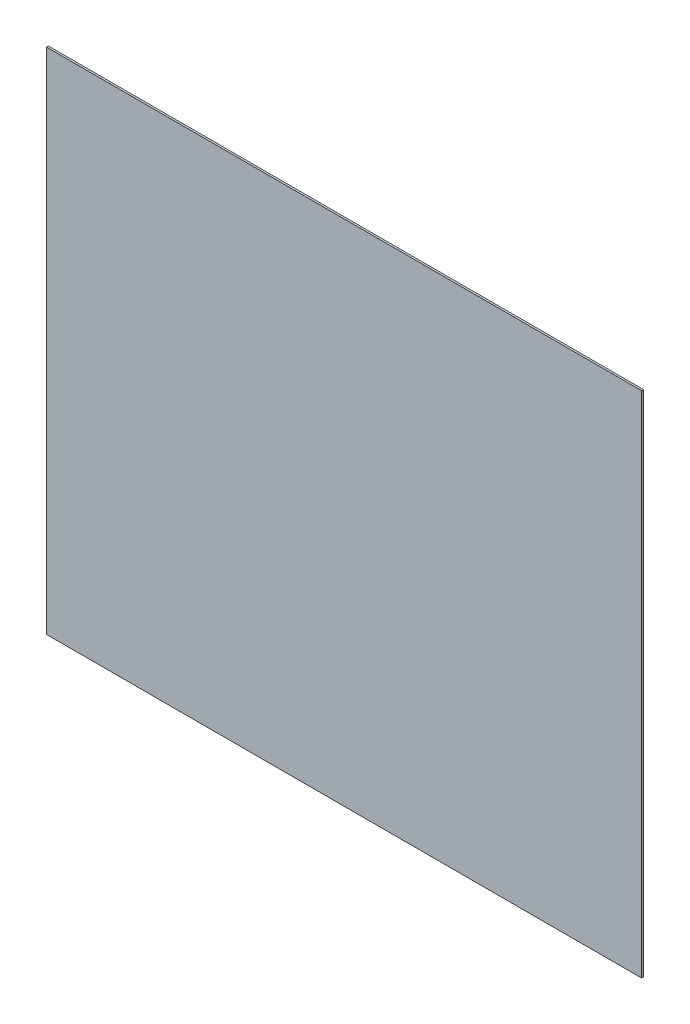
ISO-10303-21;
HEADER;
FILE_DESCRIPTION(('STEP AP214'),'2;1');
FILE_NAME('part.step','',(''),(''),'','','');
FILE_SCHEMA(('AUTOMOTIVE_DESIGN { 1 0 10303 214 1 1 1 1 }'));
ENDSEC;
DATA;
#1=APPLICATION_CONTEXT('core data for automotive mechanical design processes');
#2=APPLICATION_PROTOCOL_DEFINITION('international standard','automotive_design',2000,#1);
#3=PRODUCT_CONTEXT('',#1,'mechanical');
#4=PRODUCT('Part','Part','',(#3));
#5=PRODUCT_RELATED_PRODUCT_CATEGORY('part','',(#4));
#6=PRODUCT_DEFINITION_FORMATION('','',#4);
#7=PRODUCT_DEFINITION_CONTEXT('part definition',#1,'design');
#8=PRODUCT_DEFINITION('design','',#6,#7);
#9=PRODUCT_DEFINITION_SHAPE('','',#8);
#10=(LENGTH_UNIT() NAMED_UNIT(*) SI_UNIT(.MILLI.,.METRE.));
#11=(NAMED_UNIT(*) PLANE_ANGLE_UNIT() SI_UNIT($,.RADIAN.));
#12=(NAMED_UNIT(*) SI_UNIT($,.STERADIAN.) SOLID_ANGLE_UNIT());
#13=UNCERTAINTY_MEASURE_WITH_UNIT(LENGTH_MEASURE(1.E-05),#10,'distance_accuracy_value','');
#14=(GEOMETRIC_REPRESENTATION_CONTEXT(3) GLOBAL_UNCERTAINTY_ASSIGNED_CONTEXT((#13)) GLOBAL_UNIT_ASSIGNED_CONTEXT((#10,
#11,#12)) REPRESENTATION_CONTEXT('',''));
#15=CARTESIAN_POINT('',(0.,0.,0.));
#16=DIRECTION('',(0.,0.,1.));
#17=DIRECTION('',(1.,0.,0.));
#18=AXIS2_PLACEMENT_3D('',#15,#16,#17);
#19=CARTESIAN_POINT('',(0.,530.,2.));
#20=DIRECTION('',(1.,0.,0.));
#21=DIRECTION('',(0.,1.,0.));
#22=AXIS2_PLACEMENT_3D('',#19,#20,#21);
#23=PLANE('',#22);
#24=DIRECTION('',(0.,-1.,0.));
#25=VECTOR('',#24,1.);
#26=CARTESIAN_POINT('',(0.,530.,0.));
#27=LINE('',#26,#25);
#28=CARTESIAN_POINT('',(0.,530.,0.));
#29=VERTEX_POINT('',#28);
#30=CARTESIAN_POINT('',(0.,0.,0.));
#31=VERTEX_POINT('',#30);
#32=EDGE_CURVE('E95',#29,#31,#27,.T.);
#33=ORIENTED_EDGE('',*,*,#32,.T.);
#34=DIRECTION('',(0.,0.,-1.));
#35=VECTOR('',#34,1.);
#36=CARTESIAN_POINT('',(0.,0.,2.));
#37=LINE('',#36,#35);
#38=CARTESIAN_POINT('',(0.,0.,2.));
#39=VERTEX_POINT('',#38);
#40=EDGE_CURVE('E11',#39,#31,#37,.T.);
#41=ORIENTED_EDGE('',*,*,#40,.F.);
#42=DIRECTION('',(0.,-1.,0.));
#43=VECTOR('',#42,1.);
#44=CARTESIAN_POINT('',(0.,530.,2.));
#45=LINE('',#44,#43);
#46=CARTESIAN_POINT('',(0.,530.,2.));
#47=VERTEX_POINT('',#46);
#48=EDGE_CURVE('E83',#47,#39,#45,.T.);
#49=ORIENTED_EDGE('',*,*,#48,.F.);
#50=DIRECTION('',(0.,0.,-1.));
#51=VECTOR('',#50,1.);
#52=CARTESIAN_POINT('',(0.,530.,2.));
#53=LINE('',#52,#51);
#54=EDGE_CURVE('E91',#47,#29,#53,.T.);
#55=ORIENTED_EDGE('',*,*,#54,.T.);
#56=EDGE_LOOP('',(#33,#41,#49,#55));
#57=FACE_BOUND('',#56,.T.);
#58=ADVANCED_FACE('F32',(#57),#23,.F.);
#59=CARTESIAN_POINT('',(0.,0.,2.));
#60=DIRECTION('',(0.,1.,0.));
#61=DIRECTION('',(0.,0.,1.));
#62=AXIS2_PLACEMENT_3D('',#59,#60,#61);
#63=PLANE('',#62);
#64=DIRECTION('',(1.,0.,0.));
#65=VECTOR('',#64,1.);
#66=CARTESIAN_POINT('',(0.,0.,0.));
#67=LINE('',#66,#65);
#68=CARTESIAN_POINT('',(620.,0.,0.));
#69=VERTEX_POINT('',#68);
#70=EDGE_CURVE('E87',#31,#69,#67,.T.);
#71=ORIENTED_EDGE('',*,*,#70,.T.);
#72=DIRECTION('',(0.,0.,-1.));
#73=VECTOR('',#72,1.);
#74=CARTESIAN_POINT('',(620.,0.,2.));
#75=LINE('',#74,#73);
#76=CARTESIAN_POINT('',(620.,0.,2.));
#77=VERTEX_POINT('',#76);
#78=EDGE_CURVE('E40',#77,#69,#75,.T.);
#79=ORIENTED_EDGE('',*,*,#78,.F.);
#80=DIRECTION('',(1.,0.,0.));
#81=VECTOR('',#80,1.);
#82=CARTESIAN_POINT('',(0.,0.,2.));
#83=LINE('',#82,#81);
#84=EDGE_CURVE('E78',#39,#77,#83,.T.);
#85=ORIENTED_EDGE('',*,*,#84,.F.);
#86=ORIENTED_EDGE('',*,*,#40,.T.);
#87=EDGE_LOOP('',(#71,#79,#85,#86));
#88=FACE_BOUND('',#87,.T.);
#89=ADVANCED_FACE('F86',(#88),#63,.F.);
#90=CARTESIAN_POINT('',(620.,0.,2.));
#91=DIRECTION('',(-1.,0.,0.));
#92=DIRECTION('',(0.,0.,1.));
#93=AXIS2_PLACEMENT_3D('',#90,#91,#92);
#94=PLANE('',#93);
#95=DIRECTION('',(0.,1.,0.));
#96=VECTOR('',#95,1.);
#97=CARTESIAN_POINT('',(620.,0.,0.));
#98=LINE('',#97,#96);
#99=CARTESIAN_POINT('',(620.,530.,0.));
#100=VERTEX_POINT('',#99);
#101=EDGE_CURVE('E65',#69,#100,#98,.T.);
#102=ORIENTED_EDGE('',*,*,#101,.T.);
#103=DIRECTION('',(0.,0.,-1.));
#104=VECTOR('',#103,1.);
#105=CARTESIAN_POINT('',(620.,530.,2.));
#106=LINE('',#105,#104);
#107=CARTESIAN_POINT('',(620.,530.,2.));
#108=VERTEX_POINT('',#107);
#109=EDGE_CURVE('E88',#108,#100,#106,.T.);
#110=ORIENTED_EDGE('',*,*,#109,.F.);
#111=DIRECTION('',(0.,1.,0.));
#112=VECTOR('',#111,1.);
#113=CARTESIAN_POINT('',(620.,0.,2.));
#114=LINE('',#113,#112);
#115=EDGE_CURVE('E81',#77,#108,#114,.T.);
#116=ORIENTED_EDGE('',*,*,#115,.F.);
#117=ORIENTED_EDGE('',*,*,#78,.T.);
#118=EDGE_LOOP('',(#102,#110,#116,#117));
#119=FACE_BOUND('',#118,.T.);
#120=ADVANCED_FACE('F89',(#119),#94,.F.);
#121=CARTESIAN_POINT('',(620.,530.,2.));
#122=DIRECTION('',(0.,-1.,0.));
#123=DIRECTION('',(1.,0.,0.));
#124=AXIS2_PLACEMENT_3D('',#121,#122,#123);
#125=PLANE('',#124);
#126=DIRECTION('',(-1.,0.,0.));
#127=VECTOR('',#126,1.);
#128=CARTESIAN_POINT('',(620.,530.,0.));
#129=LINE('',#128,#127);
#130=EDGE_CURVE('E71',#100,#29,#129,.T.);
#131=ORIENTED_EDGE('',*,*,#130,.T.);
#132=ORIENTED_EDGE('',*,*,#54,.F.);
#133=DIRECTION('',(-1.,0.,0.));
#134=VECTOR('',#133,1.);
#135=CARTESIAN_POINT('',(620.,530.,2.));
#136=LINE('',#135,#134);
#137=EDGE_CURVE('E48',#108,#47,#136,.T.);
#138=ORIENTED_EDGE('',*,*,#137,.F.);
#139=ORIENTED_EDGE('',*,*,#109,.T.);
#140=EDGE_LOOP('',(#131,#132,#138,#139));
#141=FACE_BOUND('',#140,.T.);
#142=ADVANCED_FACE('F102',(#141),#125,.F.);
#143=CARTESIAN_POINT('',(0.,0.,2.));
#144=DIRECTION('',(0.,0.,1.));
#145=DIRECTION('',(1.,0.,0.));
#146=AXIS2_PLACEMENT_3D('',#143,#144,#145);
#147=PLANE('',#146);
#148=ORIENTED_EDGE('',*,*,#48,.T.);
#149=ORIENTED_EDGE('',*,*,#84,.T.);
#150=ORIENTED_EDGE('',*,*,#115,.T.);
#151=ORIENTED_EDGE('',*,*,#137,.T.);
#152=EDGE_LOOP('',(#148,#149,#150,#151));
#153=FACE_BOUND('',#152,.T.);
#154=ADVANCED_FACE('F79',(#153),#147,.T.);
#155=CARTESIAN_POINT('',(0.,0.,0.));
#156=DIRECTION('',(0.,0.,1.));
#157=DIRECTION('',(1.,0.,0.));
#158=AXIS2_PLACEMENT_3D('',#155,#156,#157);
#159=PLANE('',#158);
#160=ORIENTED_EDGE('',*,*,#32,.F.);
#161=ORIENTED_EDGE('',*,*,#130,.F.);
#162=ORIENTED_EDGE('',*,*,#101,.F.);
#163=ORIENTED_EDGE('',*,*,#70,.F.);
#164=EDGE_LOOP('',(#160,#161,#162,#163));
#165=FACE_BOUND('',#164,.T.);
#166=ADVANCED_FACE('F105',(#165),#159,.F.);
#167=CLOSED_SHELL('',(#58,#89,#120,#142,#154,#166));
#168=MANIFOLD_SOLID_BREP('B2',#167);
#169=ADVANCED_BREP_SHAPE_REPRESENTATION('',(#18,#168),#14);
#170=SHAPE_DEFINITION_REPRESENTATION(#9,#169);
ENDSEC;
END-ISO-10303-21;
